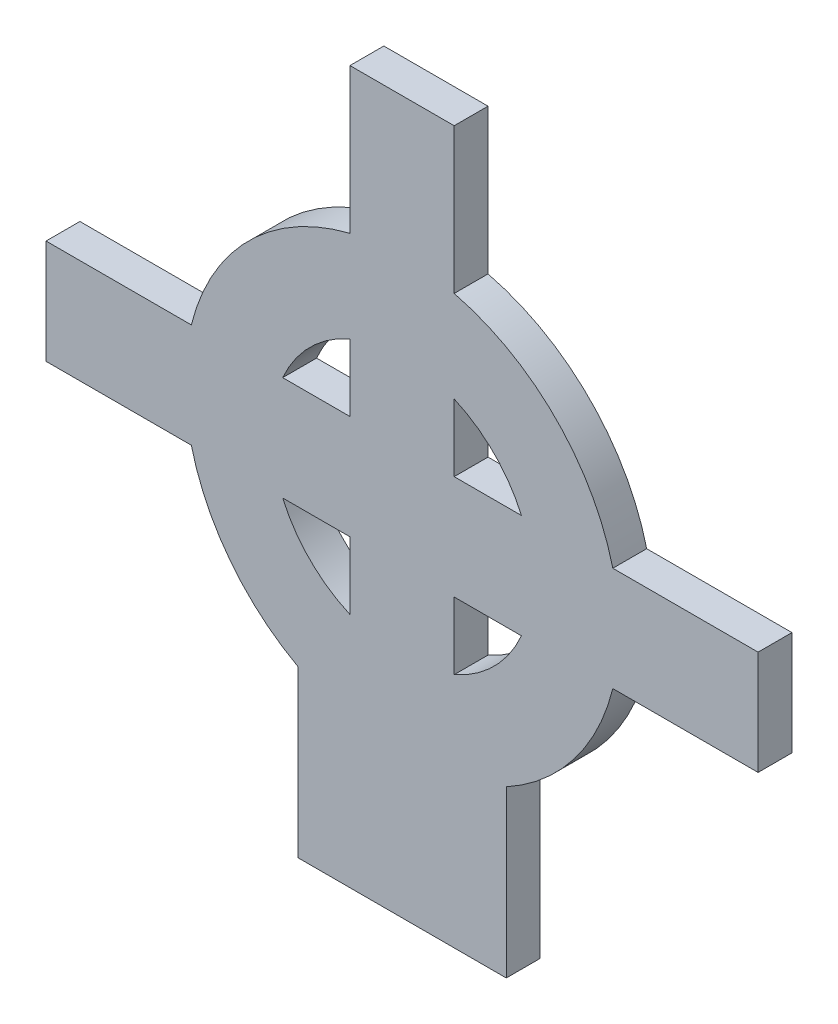
ISO-10303-21;
HEADER;
FILE_DESCRIPTION(('STEP AP214'),'2;1');
FILE_NAME('part.step','',(''),(''),'','','');
FILE_SCHEMA(('AUTOMOTIVE_DESIGN { 1 0 10303 214 1 1 1 1 }'));
ENDSEC;
DATA;
#1=APPLICATION_CONTEXT('core data for automotive mechanical design processes');
#2=APPLICATION_PROTOCOL_DEFINITION('international standard','automotive_design',2000,#1);
#3=PRODUCT_CONTEXT('',#1,'mechanical');
#4=PRODUCT('Part','Part','',(#3));
#5=PRODUCT_RELATED_PRODUCT_CATEGORY('part','',(#4));
#6=PRODUCT_DEFINITION_FORMATION('','',#4);
#7=PRODUCT_DEFINITION_CONTEXT('part definition',#1,'design');
#8=PRODUCT_DEFINITION('design','',#6,#7);
#9=PRODUCT_DEFINITION_SHAPE('','',#8);
#10=(LENGTH_UNIT() NAMED_UNIT(*) SI_UNIT(.MILLI.,.METRE.));
#11=(NAMED_UNIT(*) PLANE_ANGLE_UNIT() SI_UNIT($,.RADIAN.));
#12=(NAMED_UNIT(*) SI_UNIT($,.STERADIAN.) SOLID_ANGLE_UNIT());
#13=UNCERTAINTY_MEASURE_WITH_UNIT(LENGTH_MEASURE(1.E-05),#10,'distance_accuracy_value','');
#14=(GEOMETRIC_REPRESENTATION_CONTEXT(3) GLOBAL_UNCERTAINTY_ASSIGNED_CONTEXT((#13)) GLOBAL_UNIT_ASSIGNED_CONTEXT((#10,
#11,#12)) REPRESENTATION_CONTEXT('',''));
#15=CARTESIAN_POINT('',(0.,0.,0.));
#16=DIRECTION('',(0.,0.,1.));
#17=DIRECTION('',(1.,0.,0.));
#18=AXIS2_PLACEMENT_3D('',#15,#16,#17);
#19=CARTESIAN_POINT('',(-6.,20.5,1.95));
#20=DIRECTION('',(0.,0.,1.));
#21=DIRECTION('',(1.,0.,0.));
#22=AXIS2_PLACEMENT_3D('',#19,#20,#21);
#23=PLANE('',#22);
#24=DIRECTION('',(0.,1.,0.));
#25=VECTOR('',#24,1.);
#26=CARTESIAN_POINT('',(0.,0.,1.95));
#27=LINE('',#26,#25);
#28=CARTESIAN_POINT('',(0.,0.,1.95));
#29=VERTEX_POINT('',#28);
#30=CARTESIAN_POINT('',(0.,9.53414390026935,1.95));
#31=VERTEX_POINT('',#30);
#32=EDGE_CURVE('E317',#29,#31,#27,.T.);
#33=ORIENTED_EDGE('',*,*,#32,.T.);
#34=CARTESIAN_POINT('',(-6.,20.5,1.95));
#35=DIRECTION('',(0.,0.,1.));
#36=DIRECTION('',(1.,0.,0.));
#37=AXIS2_PLACEMENT_3D('',#34,#35,#36);
#38=CIRCLE('',#37,12.5);
#39=CARTESIAN_POINT('',(6.13466109951159,17.5,1.95));
#40=VERTEX_POINT('',#39);
#41=EDGE_CURVE('E320',#31,#40,#38,.T.);
#42=ORIENTED_EDGE('',*,*,#41,.T.);
#43=DIRECTION('',(1.,0.,0.));
#44=VECTOR('',#43,1.);
#45=CARTESIAN_POINT('',(14.5,17.5,1.95));
#46=LINE('',#45,#44);
#47=CARTESIAN_POINT('',(14.5,17.5,1.95));
#48=VERTEX_POINT('',#47);
#49=EDGE_CURVE('E323',#40,#48,#46,.T.);
#50=ORIENTED_EDGE('',*,*,#49,.T.);
#51=DIRECTION('',(0.,1.,0.));
#52=VECTOR('',#51,1.);
#53=CARTESIAN_POINT('',(14.5,17.5,1.95));
#54=LINE('',#53,#52);
#55=CARTESIAN_POINT('',(14.5,23.5,1.95));
#56=VERTEX_POINT('',#55);
#57=EDGE_CURVE('E325',#48,#56,#54,.T.);
#58=ORIENTED_EDGE('',*,*,#57,.T.);
#59=DIRECTION('',(-1.,0.,0.));
#60=VECTOR('',#59,1.);
#61=CARTESIAN_POINT('',(14.5,23.5,1.95));
#62=LINE('',#61,#60);
#63=CARTESIAN_POINT('',(6.13466109951159,23.5,1.95));
#64=VERTEX_POINT('',#63);
#65=EDGE_CURVE('E327',#56,#64,#62,.T.);
#66=ORIENTED_EDGE('',*,*,#65,.T.);
#67=CARTESIAN_POINT('',(-6.,20.5,1.95));
#68=DIRECTION('',(0.,0.,1.));
#69=DIRECTION('',(1.,0.,0.));
#70=AXIS2_PLACEMENT_3D('',#67,#68,#69);
#71=CIRCLE('',#70,12.5);
#72=CARTESIAN_POINT('',(-3.,32.6346610995116,1.95));
#73=VERTEX_POINT('',#72);
#74=EDGE_CURVE('E329',#64,#73,#71,.T.);
#75=ORIENTED_EDGE('',*,*,#74,.T.);
#76=DIRECTION('',(0.,1.,0.));
#77=VECTOR('',#76,1.);
#78=CARTESIAN_POINT('',(-3.,32.6346610995116,1.95));
#79=LINE('',#78,#77);
#80=CARTESIAN_POINT('',(-3.,41.,1.95));
#81=VERTEX_POINT('',#80);
#82=EDGE_CURVE('E331',#73,#81,#79,.T.);
#83=ORIENTED_EDGE('',*,*,#82,.T.);
#84=DIRECTION('',(-1.,0.,0.));
#85=VECTOR('',#84,1.);
#86=CARTESIAN_POINT('',(-9.,41.,1.95));
#87=LINE('',#86,#85);
#88=CARTESIAN_POINT('',(-9.,41.,1.95));
#89=VERTEX_POINT('',#88);
#90=EDGE_CURVE('E333',#81,#89,#87,.T.);
#91=ORIENTED_EDGE('',*,*,#90,.T.);
#92=DIRECTION('',(0.,-1.,0.));
#93=VECTOR('',#92,1.);
#94=CARTESIAN_POINT('',(-9.,32.6346610995116,1.95));
#95=LINE('',#94,#93);
#96=CARTESIAN_POINT('',(-9.,32.6346610995116,1.95));
#97=VERTEX_POINT('',#96);
#98=EDGE_CURVE('E335',#89,#97,#95,.T.);
#99=ORIENTED_EDGE('',*,*,#98,.T.);
#100=CARTESIAN_POINT('',(-6.,20.5,1.95));
#101=DIRECTION('',(0.,0.,1.));
#102=DIRECTION('',(1.,0.,0.));
#103=AXIS2_PLACEMENT_3D('',#100,#101,#102);
#104=CIRCLE('',#103,12.5);
#105=CARTESIAN_POINT('',(-18.1346610995116,23.5,1.95));
#106=VERTEX_POINT('',#105);
#107=EDGE_CURVE('E337',#97,#106,#104,.T.);
#108=ORIENTED_EDGE('',*,*,#107,.T.);
#109=DIRECTION('',(-1.,0.,0.));
#110=VECTOR('',#109,1.);
#111=CARTESIAN_POINT('',(-18.1346610995116,23.5,1.95));
#112=LINE('',#111,#110);
#113=CARTESIAN_POINT('',(-26.5,23.5,1.95));
#114=VERTEX_POINT('',#113);
#115=EDGE_CURVE('E339',#106,#114,#112,.T.);
#116=ORIENTED_EDGE('',*,*,#115,.T.);
#117=DIRECTION('',(0.,-1.,0.));
#118=VECTOR('',#117,1.);
#119=CARTESIAN_POINT('',(-26.5,17.5,1.95));
#120=LINE('',#119,#118);
#121=CARTESIAN_POINT('',(-26.5,17.5,1.95));
#122=VERTEX_POINT('',#121);
#123=EDGE_CURVE('E341',#114,#122,#120,.T.);
#124=ORIENTED_EDGE('',*,*,#123,.T.);
#125=DIRECTION('',(1.,0.,0.));
#126=VECTOR('',#125,1.);
#127=CARTESIAN_POINT('',(-18.1346610995116,17.5,1.95));
#128=LINE('',#127,#126);
#129=CARTESIAN_POINT('',(-18.1346610995116,17.5,1.95));
#130=VERTEX_POINT('',#129);
#131=EDGE_CURVE('E343',#122,#130,#128,.T.);
#132=ORIENTED_EDGE('',*,*,#131,.T.);
#133=CARTESIAN_POINT('',(-6.,20.5,1.95));
#134=DIRECTION('',(0.,0.,1.));
#135=DIRECTION('',(1.,0.,0.));
#136=AXIS2_PLACEMENT_3D('',#133,#134,#135);
#137=CIRCLE('',#136,12.5);
#138=CARTESIAN_POINT('',(-12.,9.53414390026935,1.95));
#139=VERTEX_POINT('',#138);
#140=EDGE_CURVE('E345',#130,#139,#137,.T.);
#141=ORIENTED_EDGE('',*,*,#140,.T.);
#142=DIRECTION('',(0.,-1.,0.));
#143=VECTOR('',#142,1.);
#144=CARTESIAN_POINT('',(-12.,0.,1.95));
#145=LINE('',#144,#143);
#146=CARTESIAN_POINT('',(-12.,0.,1.95));
#147=VERTEX_POINT('',#146);
#148=EDGE_CURVE('E347',#139,#147,#145,.T.);
#149=ORIENTED_EDGE('',*,*,#148,.T.);
#150=DIRECTION('',(1.,0.,0.));
#151=VECTOR('',#150,1.);
#152=CARTESIAN_POINT('',(0.,0.,1.95));
#153=LINE('',#152,#151);
#154=EDGE_CURVE('E349',#147,#29,#153,.T.);
#155=ORIENTED_EDGE('',*,*,#154,.T.);
#156=EDGE_LOOP('',(#33,#42,#50,#58,#66,#75,#83,#91,#99,#108,#116,#124,#132,#141,#149,#155));
#157=FACE_BOUND('',#156,.T.);
#158=DIRECTION('',(0.,1.,0.));
#159=VECTOR('',#158,1.);
#160=CARTESIAN_POINT('',(-9.,23.5,1.95));
#161=LINE('',#160,#159);
#162=CARTESIAN_POINT('',(-9.,23.5,1.95));
#163=VERTEX_POINT('',#162);
#164=CARTESIAN_POINT('',(-9.,27.3738635424338,1.95));
#165=VERTEX_POINT('',#164);
#166=EDGE_CURVE('E295',#163,#165,#161,.T.);
#167=ORIENTED_EDGE('',*,*,#166,.F.);
#168=DIRECTION('',(1.,0.,0.));
#169=VECTOR('',#168,1.);
#170=CARTESIAN_POINT('',(-9.,23.5,1.95));
#171=LINE('',#170,#169);
#172=CARTESIAN_POINT('',(-12.8738635424338,23.5,1.95));
#173=VERTEX_POINT('',#172);
#174=EDGE_CURVE('E293',#173,#163,#171,.T.);
#175=ORIENTED_EDGE('',*,*,#174,.F.);
#176=CARTESIAN_POINT('',(-6.,20.5,1.95));
#177=DIRECTION('',(0.,0.,1.));
#178=DIRECTION('',(1.,0.,0.));
#179=AXIS2_PLACEMENT_3D('',#176,#177,#178);
#180=CIRCLE('',#179,7.5);
#181=EDGE_CURVE('E299',#165,#173,#180,.T.);
#182=ORIENTED_EDGE('',*,*,#181,.F.);
#183=EDGE_LOOP('',(#167,#175,#182));
#184=FACE_BOUND('',#183,.T.);
#185=DIRECTION('',(0.,-1.,0.));
#186=VECTOR('',#185,1.);
#187=CARTESIAN_POINT('',(-3.,23.5,1.95));
#188=LINE('',#187,#186);
#189=CARTESIAN_POINT('',(-3.,27.3738635424338,1.95));
#190=VERTEX_POINT('',#189);
#191=CARTESIAN_POINT('',(-3.,23.5,1.95));
#192=VERTEX_POINT('',#191);
#193=EDGE_CURVE('E271',#190,#192,#188,.T.);
#194=ORIENTED_EDGE('',*,*,#193,.F.);
#195=CARTESIAN_POINT('',(-6.,20.5,1.95));
#196=DIRECTION('',(0.,0.,1.));
#197=DIRECTION('',(1.,0.,0.));
#198=AXIS2_PLACEMENT_3D('',#195,#196,#197);
#199=CIRCLE('',#198,7.5);
#200=CARTESIAN_POINT('',(0.87386354243376,23.5,1.95));
#201=VERTEX_POINT('',#200);
#202=EDGE_CURVE('E269',#201,#190,#199,.T.);
#203=ORIENTED_EDGE('',*,*,#202,.F.);
#204=DIRECTION('',(1.,0.,0.));
#205=VECTOR('',#204,1.);
#206=CARTESIAN_POINT('',(0.87386354243376,23.5,1.95));
#207=LINE('',#206,#205);
#208=EDGE_CURVE('E275',#192,#201,#207,.T.);
#209=ORIENTED_EDGE('',*,*,#208,.F.);
#210=EDGE_LOOP('',(#194,#203,#209));
#211=FACE_BOUND('',#210,.T.);
#212=CARTESIAN_POINT('',(-6.,20.5,1.95));
#213=DIRECTION('',(0.,0.,1.));
#214=DIRECTION('',(1.,0.,0.));
#215=AXIS2_PLACEMENT_3D('',#212,#213,#214);
#216=CIRCLE('',#215,7.5);
#217=CARTESIAN_POINT('',(-12.8738635424338,17.5,1.95));
#218=VERTEX_POINT('',#217);
#219=CARTESIAN_POINT('',(-9.,13.6261364575662,1.95));
#220=VERTEX_POINT('',#219);
#221=EDGE_CURVE('E247',#218,#220,#216,.T.);
#222=ORIENTED_EDGE('',*,*,#221,.F.);
#223=DIRECTION('',(-1.,0.,0.));
#224=VECTOR('',#223,1.);
#225=CARTESIAN_POINT('',(-9.,17.5,1.95));
#226=LINE('',#225,#224);
#227=CARTESIAN_POINT('',(-9.,17.5,1.95));
#228=VERTEX_POINT('',#227);
#229=EDGE_CURVE('E245',#228,#218,#226,.T.);
#230=ORIENTED_EDGE('',*,*,#229,.F.);
#231=DIRECTION('',(0.,1.,0.));
#232=VECTOR('',#231,1.);
#233=CARTESIAN_POINT('',(-9.,17.5,1.95));
#234=LINE('',#233,#232);
#235=EDGE_CURVE('E251',#220,#228,#234,.T.);
#236=ORIENTED_EDGE('',*,*,#235,.F.);
#237=EDGE_LOOP('',(#222,#230,#236));
#238=FACE_BOUND('',#237,.T.);
#239=DIRECTION('',(0.,-1.,0.));
#240=VECTOR('',#239,1.);
#241=CARTESIAN_POINT('',(-3.,17.5,1.95));
#242=LINE('',#241,#240);
#243=CARTESIAN_POINT('',(-3.,17.5,1.95));
#244=VERTEX_POINT('',#243);
#245=CARTESIAN_POINT('',(-3.,13.6261364575662,1.95));
#246=VERTEX_POINT('',#245);
#247=EDGE_CURVE('E226',#244,#246,#242,.T.);
#248=ORIENTED_EDGE('',*,*,#247,.F.);
#249=DIRECTION('',(-1.,0.,0.));
#250=VECTOR('',#249,1.);
#251=CARTESIAN_POINT('',(0.87386354243376,17.5,1.95));
#252=LINE('',#251,#250);
#253=CARTESIAN_POINT('',(0.873863542433758,17.5,1.95));
#254=VERTEX_POINT('',#253);
#255=EDGE_CURVE('E218',#254,#244,#252,.T.);
#256=ORIENTED_EDGE('',*,*,#255,.F.);
#257=CARTESIAN_POINT('',(-6.,20.5,1.95));
#258=DIRECTION('',(0.,0.,1.));
#259=DIRECTION('',(1.,0.,0.));
#260=AXIS2_PLACEMENT_3D('',#257,#258,#259);
#261=CIRCLE('',#260,7.5);
#262=EDGE_CURVE('E235',#246,#254,#261,.T.);
#263=ORIENTED_EDGE('',*,*,#262,.F.);
#264=EDGE_LOOP('',(#248,#256,#263));
#265=FACE_BOUND('',#264,.T.);
#266=ADVANCED_FACE('F33',(#157,#184,#211,#238,#265),#23,.T.);
#267=CARTESIAN_POINT('',(-6.,20.5,0.));
#268=DIRECTION('',(0.,0.,1.));
#269=DIRECTION('',(1.,0.,0.));
#270=AXIS2_PLACEMENT_3D('',#267,#268,#269);
#271=PLANE('',#270);
#272=DIRECTION('',(-1.,0.,0.));
#273=VECTOR('',#272,1.);
#274=CARTESIAN_POINT('',(-9.,17.5,0.));
#275=LINE('',#274,#273);
#276=CARTESIAN_POINT('',(-9.,17.5,0.));
#277=VERTEX_POINT('',#276);
#278=CARTESIAN_POINT('',(-12.8738635424338,17.5,0.));
#279=VERTEX_POINT('',#278);
#280=EDGE_CURVE('E233',#277,#279,#275,.T.);
#281=ORIENTED_EDGE('',*,*,#280,.T.);
#282=CARTESIAN_POINT('',(-6.,20.5,0.));
#283=DIRECTION('',(0.,0.,1.));
#284=DIRECTION('',(1.,0.,0.));
#285=AXIS2_PLACEMENT_3D('',#282,#283,#284);
#286=CIRCLE('',#285,7.5);
#287=CARTESIAN_POINT('',(-9.,13.6261364575662,0.));
#288=VERTEX_POINT('',#287);
#289=EDGE_CURVE('E256',#279,#288,#286,.T.);
#290=ORIENTED_EDGE('',*,*,#289,.T.);
#291=DIRECTION('',(0.,1.,0.));
#292=VECTOR('',#291,1.);
#293=CARTESIAN_POINT('',(-9.,17.5,0.));
#294=LINE('',#293,#292);
#295=EDGE_CURVE('E248',#288,#277,#294,.T.);
#296=ORIENTED_EDGE('',*,*,#295,.T.);
#297=EDGE_LOOP('',(#281,#290,#296));
#298=FACE_BOUND('',#297,.T.);
#299=DIRECTION('',(1.,0.,0.));
#300=VECTOR('',#299,1.);
#301=CARTESIAN_POINT('',(-9.,23.5,0.));
#302=LINE('',#301,#300);
#303=CARTESIAN_POINT('',(-12.8738635424338,23.5,0.));
#304=VERTEX_POINT('',#303);
#305=CARTESIAN_POINT('',(-9.,23.5,0.));
#306=VERTEX_POINT('',#305);
#307=EDGE_CURVE('E292',#304,#306,#302,.T.);
#308=ORIENTED_EDGE('',*,*,#307,.T.);
#309=DIRECTION('',(0.,1.,0.));
#310=VECTOR('',#309,1.);
#311=CARTESIAN_POINT('',(-9.,23.5,0.));
#312=LINE('',#311,#310);
#313=CARTESIAN_POINT('',(-9.,27.3738635424338,0.));
#314=VERTEX_POINT('',#313);
#315=EDGE_CURVE('E304',#306,#314,#312,.T.);
#316=ORIENTED_EDGE('',*,*,#315,.T.);
#317=CARTESIAN_POINT('',(-6.,20.5,0.));
#318=DIRECTION('',(0.,0.,1.));
#319=DIRECTION('',(1.,0.,0.));
#320=AXIS2_PLACEMENT_3D('',#317,#318,#319);
#321=CIRCLE('',#320,7.5);
#322=EDGE_CURVE('E296',#314,#304,#321,.T.);
#323=ORIENTED_EDGE('',*,*,#322,.T.);
#324=EDGE_LOOP('',(#308,#316,#323));
#325=FACE_BOUND('',#324,.T.);
#326=DIRECTION('',(0.,1.,0.));
#327=VECTOR('',#326,1.);
#328=CARTESIAN_POINT('',(0.,0.,0.));
#329=LINE('',#328,#327);
#330=CARTESIAN_POINT('',(0.,0.,0.));
#331=VERTEX_POINT('',#330);
#332=CARTESIAN_POINT('',(0.,9.53414390026935,0.));
#333=VERTEX_POINT('',#332);
#334=EDGE_CURVE('E316',#331,#333,#329,.T.);
#335=ORIENTED_EDGE('',*,*,#334,.F.);
#336=DIRECTION('',(1.,0.,0.));
#337=VECTOR('',#336,1.);
#338=CARTESIAN_POINT('',(0.,0.,0.));
#339=LINE('',#338,#337);
#340=CARTESIAN_POINT('',(-12.,0.,0.));
#341=VERTEX_POINT('',#340);
#342=EDGE_CURVE('E321',#341,#331,#339,.T.);
#343=ORIENTED_EDGE('',*,*,#342,.F.);
#344=DIRECTION('',(0.,-1.,0.));
#345=VECTOR('',#344,1.);
#346=CARTESIAN_POINT('',(-12.,0.,0.));
#347=LINE('',#346,#345);
#348=CARTESIAN_POINT('',(-12.,9.53414390026935,0.));
#349=VERTEX_POINT('',#348);
#350=EDGE_CURVE('E380',#349,#341,#347,.T.);
#351=ORIENTED_EDGE('',*,*,#350,.F.);
#352=CARTESIAN_POINT('',(-6.,20.5,0.));
#353=DIRECTION('',(0.,0.,1.));
#354=DIRECTION('',(1.,0.,0.));
#355=AXIS2_PLACEMENT_3D('',#352,#353,#354);
#356=CIRCLE('',#355,12.5);
#357=CARTESIAN_POINT('',(-18.1346610995116,17.5,0.));
#358=VERTEX_POINT('',#357);
#359=EDGE_CURVE('E378',#358,#349,#356,.T.);
#360=ORIENTED_EDGE('',*,*,#359,.F.);
#361=DIRECTION('',(1.,0.,0.));
#362=VECTOR('',#361,1.);
#363=CARTESIAN_POINT('',(-18.1346610995116,17.5,0.));
#364=LINE('',#363,#362);
#365=CARTESIAN_POINT('',(-26.5,17.5,0.));
#366=VERTEX_POINT('',#365);
#367=EDGE_CURVE('E376',#366,#358,#364,.T.);
#368=ORIENTED_EDGE('',*,*,#367,.F.);
#369=DIRECTION('',(0.,-1.,0.));
#370=VECTOR('',#369,1.);
#371=CARTESIAN_POINT('',(-26.5,17.5,0.));
#372=LINE('',#371,#370);
#373=CARTESIAN_POINT('',(-26.5,23.5,0.));
#374=VERTEX_POINT('',#373);
#375=EDGE_CURVE('E374',#374,#366,#372,.T.);
#376=ORIENTED_EDGE('',*,*,#375,.F.);
#377=DIRECTION('',(-1.,0.,0.));
#378=VECTOR('',#377,1.);
#379=CARTESIAN_POINT('',(-18.1346610995116,23.5,0.));
#380=LINE('',#379,#378);
#381=CARTESIAN_POINT('',(-18.1346610995116,23.5,0.));
#382=VERTEX_POINT('',#381);
#383=EDGE_CURVE('E372',#382,#374,#380,.T.);
#384=ORIENTED_EDGE('',*,*,#383,.F.);
#385=CARTESIAN_POINT('',(-6.,20.5,0.));
#386=DIRECTION('',(0.,0.,1.));
#387=DIRECTION('',(1.,0.,0.));
#388=AXIS2_PLACEMENT_3D('',#385,#386,#387);
#389=CIRCLE('',#388,12.5);
#390=CARTESIAN_POINT('',(-9.,32.6346610995116,0.));
#391=VERTEX_POINT('',#390);
#392=EDGE_CURVE('E370',#391,#382,#389,.T.);
#393=ORIENTED_EDGE('',*,*,#392,.F.);
#394=DIRECTION('',(0.,-1.,0.));
#395=VECTOR('',#394,1.);
#396=CARTESIAN_POINT('',(-9.,32.6346610995116,0.));
#397=LINE('',#396,#395);
#398=CARTESIAN_POINT('',(-9.,41.,0.));
#399=VERTEX_POINT('',#398);
#400=EDGE_CURVE('E368',#399,#391,#397,.T.);
#401=ORIENTED_EDGE('',*,*,#400,.F.);
#402=DIRECTION('',(-1.,0.,0.));
#403=VECTOR('',#402,1.);
#404=CARTESIAN_POINT('',(-9.,41.,0.));
#405=LINE('',#404,#403);
#406=CARTESIAN_POINT('',(-3.,41.,0.));
#407=VERTEX_POINT('',#406);
#408=EDGE_CURVE('E366',#407,#399,#405,.T.);
#409=ORIENTED_EDGE('',*,*,#408,.F.);
#410=DIRECTION('',(0.,1.,0.));
#411=VECTOR('',#410,1.);
#412=CARTESIAN_POINT('',(-3.,32.6346610995116,0.));
#413=LINE('',#412,#411);
#414=CARTESIAN_POINT('',(-3.,32.6346610995116,0.));
#415=VERTEX_POINT('',#414);
#416=EDGE_CURVE('E364',#415,#407,#413,.T.);
#417=ORIENTED_EDGE('',*,*,#416,.F.);
#418=CARTESIAN_POINT('',(-6.,20.5,0.));
#419=DIRECTION('',(0.,0.,1.));
#420=DIRECTION('',(1.,0.,0.));
#421=AXIS2_PLACEMENT_3D('',#418,#419,#420);
#422=CIRCLE('',#421,12.5);
#423=CARTESIAN_POINT('',(6.13466109951159,23.5,0.));
#424=VERTEX_POINT('',#423);
#425=EDGE_CURVE('E362',#424,#415,#422,.T.);
#426=ORIENTED_EDGE('',*,*,#425,.F.);
#427=DIRECTION('',(-1.,0.,0.));
#428=VECTOR('',#427,1.);
#429=CARTESIAN_POINT('',(14.5,23.5,0.));
#430=LINE('',#429,#428);
#431=CARTESIAN_POINT('',(14.5,23.5,0.));
#432=VERTEX_POINT('',#431);
#433=EDGE_CURVE('E360',#432,#424,#430,.T.);
#434=ORIENTED_EDGE('',*,*,#433,.F.);
#435=DIRECTION('',(0.,1.,0.));
#436=VECTOR('',#435,1.);
#437=CARTESIAN_POINT('',(14.5,17.5,0.));
#438=LINE('',#437,#436);
#439=CARTESIAN_POINT('',(14.5,17.5,0.));
#440=VERTEX_POINT('',#439);
#441=EDGE_CURVE('E358',#440,#432,#438,.T.);
#442=ORIENTED_EDGE('',*,*,#441,.F.);
#443=DIRECTION('',(1.,0.,0.));
#444=VECTOR('',#443,1.);
#445=CARTESIAN_POINT('',(14.5,17.5,0.));
#446=LINE('',#445,#444);
#447=CARTESIAN_POINT('',(6.13466109951159,17.5,0.));
#448=VERTEX_POINT('',#447);
#449=EDGE_CURVE('E356',#448,#440,#446,.T.);
#450=ORIENTED_EDGE('',*,*,#449,.F.);
#451=CARTESIAN_POINT('',(-6.,20.5,0.));
#452=DIRECTION('',(0.,0.,1.));
#453=DIRECTION('',(1.,0.,0.));
#454=AXIS2_PLACEMENT_3D('',#451,#452,#453);
#455=CIRCLE('',#454,12.5);
#456=EDGE_CURVE('E354',#333,#448,#455,.T.);
#457=ORIENTED_EDGE('',*,*,#456,.F.);
#458=EDGE_LOOP('',(#335,#343,#351,#360,#368,#376,#384,#393,#401,#409,#417,#426,#434,#442,#450,#457));
#459=FACE_BOUND('',#458,.T.);
#460=CARTESIAN_POINT('',(-6.,20.5,0.));
#461=DIRECTION('',(0.,0.,1.));
#462=DIRECTION('',(1.,0.,0.));
#463=AXIS2_PLACEMENT_3D('',#460,#461,#462);
#464=CIRCLE('',#463,7.5);
#465=CARTESIAN_POINT('',(0.87386354243376,23.5,0.));
#466=VERTEX_POINT('',#465);
#467=CARTESIAN_POINT('',(-3.,27.3738635424338,0.));
#468=VERTEX_POINT('',#467);
#469=EDGE_CURVE('E268',#466,#468,#464,.T.);
#470=ORIENTED_EDGE('',*,*,#469,.T.);
#471=DIRECTION('',(0.,-1.,0.));
#472=VECTOR('',#471,1.);
#473=CARTESIAN_POINT('',(-3.,23.5,0.));
#474=LINE('',#473,#472);
#475=CARTESIAN_POINT('',(-3.,23.5,0.));
#476=VERTEX_POINT('',#475);
#477=EDGE_CURVE('E280',#468,#476,#474,.T.);
#478=ORIENTED_EDGE('',*,*,#477,.T.);
#479=DIRECTION('',(1.,0.,0.));
#480=VECTOR('',#479,1.);
#481=CARTESIAN_POINT('',(0.87386354243376,23.5,0.));
#482=LINE('',#481,#480);
#483=EDGE_CURVE('E272',#476,#466,#482,.T.);
#484=ORIENTED_EDGE('',*,*,#483,.T.);
#485=EDGE_LOOP('',(#470,#478,#484));
#486=FACE_BOUND('',#485,.T.);
#487=DIRECTION('',(-1.,0.,0.));
#488=VECTOR('',#487,1.);
#489=CARTESIAN_POINT('',(0.87386354243376,17.5,0.));
#490=LINE('',#489,#488);
#491=CARTESIAN_POINT('',(0.873863542433759,17.5,0.));
#492=VERTEX_POINT('',#491);
#493=CARTESIAN_POINT('',(-3.,17.5,0.));
#494=VERTEX_POINT('',#493);
#495=EDGE_CURVE('E56',#492,#494,#490,.T.);
#496=ORIENTED_EDGE('',*,*,#495,.T.);
#497=DIRECTION('',(0.,-1.,0.));
#498=VECTOR('',#497,1.);
#499=CARTESIAN_POINT('',(-3.,17.5,0.));
#500=LINE('',#499,#498);
#501=CARTESIAN_POINT('',(-3.,13.6261364575662,0.));
#502=VERTEX_POINT('',#501);
#503=EDGE_CURVE('E232',#494,#502,#500,.T.);
#504=ORIENTED_EDGE('',*,*,#503,.T.);
#505=CARTESIAN_POINT('',(-6.,20.5,0.));
#506=DIRECTION('',(0.,0.,1.));
#507=DIRECTION('',(1.,0.,0.));
#508=AXIS2_PLACEMENT_3D('',#505,#506,#507);
#509=CIRCLE('',#508,7.5);
#510=EDGE_CURVE('E227',#502,#492,#509,.T.);
#511=ORIENTED_EDGE('',*,*,#510,.T.);
#512=EDGE_LOOP('',(#496,#504,#511));
#513=FACE_BOUND('',#512,.T.);
#514=ADVANCED_FACE('F434',(#298,#325,#459,#486,#513),#271,.F.);
#515=CARTESIAN_POINT('',(0.,0.,1.95));
#516=DIRECTION('',(-1.,0.,0.));
#517=DIRECTION('',(0.,-1.,0.));
#518=AXIS2_PLACEMENT_3D('',#515,#516,#517);
#519=PLANE('',#518);
#520=ORIENTED_EDGE('',*,*,#334,.T.);
#521=DIRECTION('',(0.,0.,-1.));
#522=VECTOR('',#521,1.);
#523=CARTESIAN_POINT('',(0.,9.53414390026935,1.95));
#524=LINE('',#523,#522);
#525=EDGE_CURVE('E11',#31,#333,#524,.T.);
#526=ORIENTED_EDGE('',*,*,#525,.F.);
#527=ORIENTED_EDGE('',*,*,#32,.F.);
#528=DIRECTION('',(0.,0.,-1.));
#529=VECTOR('',#528,1.);
#530=CARTESIAN_POINT('',(0.,0.,1.95));
#531=LINE('',#530,#529);
#532=EDGE_CURVE('E351',#29,#331,#531,.T.);
#533=ORIENTED_EDGE('',*,*,#532,.T.);
#534=EDGE_LOOP('',(#520,#526,#527,#533));
#535=FACE_BOUND('',#534,.T.);
#536=ADVANCED_FACE('F35',(#535),#519,.F.);
#537=CARTESIAN_POINT('',(-6.,20.5,1.95));
#538=DIRECTION('',(0.,0.,-1.));
#539=DIRECTION('',(-1.,0.,0.));
#540=AXIS2_PLACEMENT_3D('',#537,#538,#539);
#541=CYLINDRICAL_SURFACE('',#540,12.5);
#542=ORIENTED_EDGE('',*,*,#456,.T.);
#543=DIRECTION('',(0.,0.,-1.));
#544=VECTOR('',#543,1.);
#545=CARTESIAN_POINT('',(6.13466109951159,17.5,1.95));
#546=LINE('',#545,#544);
#547=EDGE_CURVE('E41',#40,#448,#546,.T.);
#548=ORIENTED_EDGE('',*,*,#547,.F.);
#549=ORIENTED_EDGE('',*,*,#41,.F.);
#550=ORIENTED_EDGE('',*,*,#525,.T.);
#551=EDGE_LOOP('',(#542,#548,#549,#550));
#552=FACE_BOUND('',#551,.T.);
#553=ADVANCED_FACE('F452',(#552),#541,.T.);
#554=CARTESIAN_POINT('',(14.5,17.5,1.95));
#555=DIRECTION('',(0.,1.,0.));
#556=DIRECTION('',(0.,0.,1.));
#557=AXIS2_PLACEMENT_3D('',#554,#555,#556);
#558=PLANE('',#557);
#559=ORIENTED_EDGE('',*,*,#449,.T.);
#560=DIRECTION('',(0.,0.,-1.));
#561=VECTOR('',#560,1.);
#562=CARTESIAN_POINT('',(14.5,17.5,1.95));
#563=LINE('',#562,#561);
#564=EDGE_CURVE('E421',#48,#440,#563,.T.);
#565=ORIENTED_EDGE('',*,*,#564,.F.);
#566=ORIENTED_EDGE('',*,*,#49,.F.);
#567=ORIENTED_EDGE('',*,*,#547,.T.);
#568=EDGE_LOOP('',(#559,#565,#566,#567));
#569=FACE_BOUND('',#568,.T.);
#570=ADVANCED_FACE('F428',(#569),#558,.F.);
#571=CARTESIAN_POINT('',(14.5,17.5,1.95));
#572=DIRECTION('',(-1.,0.,0.));
#573=DIRECTION('',(0.,0.,1.));
#574=AXIS2_PLACEMENT_3D('',#571,#572,#573);
#575=PLANE('',#574);
#576=ORIENTED_EDGE('',*,*,#441,.T.);
#577=DIRECTION('',(0.,0.,-1.));
#578=VECTOR('',#577,1.);
#579=CARTESIAN_POINT('',(14.5,23.5,1.95));
#580=LINE('',#579,#578);
#581=EDGE_CURVE('E418',#56,#432,#580,.T.);
#582=ORIENTED_EDGE('',*,*,#581,.F.);
#583=ORIENTED_EDGE('',*,*,#57,.F.);
#584=ORIENTED_EDGE('',*,*,#564,.T.);
#585=EDGE_LOOP('',(#576,#582,#583,#584));
#586=FACE_BOUND('',#585,.T.);
#587=ADVANCED_FACE('F440',(#586),#575,.F.);
#588=CARTESIAN_POINT('',(14.5,23.5,1.95));
#589=DIRECTION('',(0.,-1.,0.));
#590=DIRECTION('',(0.,0.,-1.));
#591=AXIS2_PLACEMENT_3D('',#588,#589,#590);
#592=PLANE('',#591);
#593=ORIENTED_EDGE('',*,*,#433,.T.);
#594=DIRECTION('',(0.,0.,-1.));
#595=VECTOR('',#594,1.);
#596=CARTESIAN_POINT('',(6.13466109951159,23.5,1.95));
#597=LINE('',#596,#595);
#598=EDGE_CURVE('E415',#64,#424,#597,.T.);
#599=ORIENTED_EDGE('',*,*,#598,.F.);
#600=ORIENTED_EDGE('',*,*,#65,.F.);
#601=ORIENTED_EDGE('',*,*,#581,.T.);
#602=EDGE_LOOP('',(#593,#599,#600,#601));
#603=FACE_BOUND('',#602,.T.);
#604=ADVANCED_FACE('F444',(#603),#592,.F.);
#605=CARTESIAN_POINT('',(-6.,20.5,1.95));
#606=DIRECTION('',(0.,0.,-1.));
#607=DIRECTION('',(-1.,0.,0.));
#608=AXIS2_PLACEMENT_3D('',#605,#606,#607);
#609=CYLINDRICAL_SURFACE('',#608,12.5);
#610=ORIENTED_EDGE('',*,*,#425,.T.);
#611=DIRECTION('',(0.,0.,-1.));
#612=VECTOR('',#611,1.);
#613=CARTESIAN_POINT('',(-3.,32.6346610995116,1.95));
#614=LINE('',#613,#612);
#615=EDGE_CURVE('E412',#73,#415,#614,.T.);
#616=ORIENTED_EDGE('',*,*,#615,.F.);
#617=ORIENTED_EDGE('',*,*,#74,.F.);
#618=ORIENTED_EDGE('',*,*,#598,.T.);
#619=EDGE_LOOP('',(#610,#616,#617,#618));
#620=FACE_BOUND('',#619,.T.);
#621=ADVANCED_FACE('F505',(#620),#609,.T.);
#622=CARTESIAN_POINT('',(-3.,32.6346610995116,1.95));
#623=DIRECTION('',(-1.,0.,0.));
#624=DIRECTION('',(0.,-1.,0.));
#625=AXIS2_PLACEMENT_3D('',#622,#623,#624);
#626=PLANE('',#625);
#627=ORIENTED_EDGE('',*,*,#416,.T.);
#628=DIRECTION('',(0.,0.,-1.));
#629=VECTOR('',#628,1.);
#630=CARTESIAN_POINT('',(-3.,41.,1.95));
#631=LINE('',#630,#629);
#632=EDGE_CURVE('E409',#81,#407,#631,.T.);
#633=ORIENTED_EDGE('',*,*,#632,.F.);
#634=ORIENTED_EDGE('',*,*,#82,.F.);
#635=ORIENTED_EDGE('',*,*,#615,.T.);
#636=EDGE_LOOP('',(#627,#633,#634,#635));
#637=FACE_BOUND('',#636,.T.);
#638=ADVANCED_FACE('F502',(#637),#626,.F.);
#639=CARTESIAN_POINT('',(-9.,41.,1.95));
#640=DIRECTION('',(0.,-1.,0.));
#641=DIRECTION('',(0.,0.,-1.));
#642=AXIS2_PLACEMENT_3D('',#639,#640,#641);
#643=PLANE('',#642);
#644=ORIENTED_EDGE('',*,*,#408,.T.);
#645=DIRECTION('',(0.,0.,-1.));
#646=VECTOR('',#645,1.);
#647=CARTESIAN_POINT('',(-9.,41.,1.95));
#648=LINE('',#647,#646);
#649=EDGE_CURVE('E406',#89,#399,#648,.T.);
#650=ORIENTED_EDGE('',*,*,#649,.F.);
#651=ORIENTED_EDGE('',*,*,#90,.F.);
#652=ORIENTED_EDGE('',*,*,#632,.T.);
#653=EDGE_LOOP('',(#644,#650,#651,#652));
#654=FACE_BOUND('',#653,.T.);
#655=ADVANCED_FACE('F498',(#654),#643,.F.);
#656=CARTESIAN_POINT('',(-9.,32.6346610995116,1.95));
#657=DIRECTION('',(1.,0.,0.));
#658=DIRECTION('',(0.,0.,-1.));
#659=AXIS2_PLACEMENT_3D('',#656,#657,#658);
#660=PLANE('',#659);
#661=ORIENTED_EDGE('',*,*,#400,.T.);
#662=DIRECTION('',(0.,0.,-1.));
#663=VECTOR('',#662,1.);
#664=CARTESIAN_POINT('',(-9.,32.6346610995116,1.95));
#665=LINE('',#664,#663);
#666=EDGE_CURVE('E403',#97,#391,#665,.T.);
#667=ORIENTED_EDGE('',*,*,#666,.F.);
#668=ORIENTED_EDGE('',*,*,#98,.F.);
#669=ORIENTED_EDGE('',*,*,#649,.T.);
#670=EDGE_LOOP('',(#661,#667,#668,#669));
#671=FACE_BOUND('',#670,.T.);
#672=ADVANCED_FACE('F494',(#671),#660,.F.);
#673=CARTESIAN_POINT('',(-6.,20.5,1.95));
#674=DIRECTION('',(0.,0.,-1.));
#675=DIRECTION('',(-1.,0.,0.));
#676=AXIS2_PLACEMENT_3D('',#673,#674,#675);
#677=CYLINDRICAL_SURFACE('',#676,12.5);
#678=ORIENTED_EDGE('',*,*,#392,.T.);
#679=DIRECTION('',(0.,0.,-1.));
#680=VECTOR('',#679,1.);
#681=CARTESIAN_POINT('',(-18.1346610995116,23.5,1.95));
#682=LINE('',#681,#680);
#683=EDGE_CURVE('E400',#106,#382,#682,.T.);
#684=ORIENTED_EDGE('',*,*,#683,.F.);
#685=ORIENTED_EDGE('',*,*,#107,.F.);
#686=ORIENTED_EDGE('',*,*,#666,.T.);
#687=EDGE_LOOP('',(#678,#684,#685,#686));
#688=FACE_BOUND('',#687,.T.);
#689=ADVANCED_FACE('F489',(#688),#677,.T.);
#690=CARTESIAN_POINT('',(-18.1346610995116,23.5,1.95));
#691=DIRECTION('',(0.,-1.,0.));
#692=DIRECTION('',(0.,0.,-1.));
#693=AXIS2_PLACEMENT_3D('',#690,#691,#692);
#694=PLANE('',#693);
#695=ORIENTED_EDGE('',*,*,#383,.T.);
#696=DIRECTION('',(0.,0.,-1.));
#697=VECTOR('',#696,1.);
#698=CARTESIAN_POINT('',(-26.5,23.5,1.95));
#699=LINE('',#698,#697);
#700=EDGE_CURVE('E397',#114,#374,#699,.T.);
#701=ORIENTED_EDGE('',*,*,#700,.F.);
#702=ORIENTED_EDGE('',*,*,#115,.F.);
#703=ORIENTED_EDGE('',*,*,#683,.T.);
#704=EDGE_LOOP('',(#695,#701,#702,#703));
#705=FACE_BOUND('',#704,.T.);
#706=ADVANCED_FACE('F483',(#705),#694,.F.);
#707=CARTESIAN_POINT('',(-26.5,17.5,1.95));
#708=DIRECTION('',(1.,0.,0.));
#709=DIRECTION('',(0.,0.,-1.));
#710=AXIS2_PLACEMENT_3D('',#707,#708,#709);
#711=PLANE('',#710);
#712=ORIENTED_EDGE('',*,*,#375,.T.);
#713=DIRECTION('',(0.,0.,-1.));
#714=VECTOR('',#713,1.);
#715=CARTESIAN_POINT('',(-26.5,17.5,1.95));
#716=LINE('',#715,#714);
#717=EDGE_CURVE('E394',#122,#366,#716,.T.);
#718=ORIENTED_EDGE('',*,*,#717,.F.);
#719=ORIENTED_EDGE('',*,*,#123,.F.);
#720=ORIENTED_EDGE('',*,*,#700,.T.);
#721=EDGE_LOOP('',(#712,#718,#719,#720));
#722=FACE_BOUND('',#721,.T.);
#723=ADVANCED_FACE('F479',(#722),#711,.F.);
#724=CARTESIAN_POINT('',(-18.1346610995116,17.5,1.95));
#725=DIRECTION('',(0.,1.,0.));
#726=DIRECTION('',(0.,0.,1.));
#727=AXIS2_PLACEMENT_3D('',#724,#725,#726);
#728=PLANE('',#727);
#729=ORIENTED_EDGE('',*,*,#367,.T.);
#730=DIRECTION('',(0.,0.,-1.));
#731=VECTOR('',#730,1.);
#732=CARTESIAN_POINT('',(-18.1346610995116,17.5,1.95));
#733=LINE('',#732,#731);
#734=EDGE_CURVE('E391',#130,#358,#733,.T.);
#735=ORIENTED_EDGE('',*,*,#734,.F.);
#736=ORIENTED_EDGE('',*,*,#131,.F.);
#737=ORIENTED_EDGE('',*,*,#717,.T.);
#738=EDGE_LOOP('',(#729,#735,#736,#737));
#739=FACE_BOUND('',#738,.T.);
#740=ADVANCED_FACE('F474',(#739),#728,.F.);
#741=CARTESIAN_POINT('',(-6.,20.5,1.95));
#742=DIRECTION('',(0.,0.,-1.));
#743=DIRECTION('',(-1.,0.,0.));
#744=AXIS2_PLACEMENT_3D('',#741,#742,#743);
#745=CYLINDRICAL_SURFACE('',#744,12.5);
#746=ORIENTED_EDGE('',*,*,#359,.T.);
#747=DIRECTION('',(0.,0.,-1.));
#748=VECTOR('',#747,1.);
#749=CARTESIAN_POINT('',(-12.,9.53414390026935,1.95));
#750=LINE('',#749,#748);
#751=EDGE_CURVE('E388',#139,#349,#750,.T.);
#752=ORIENTED_EDGE('',*,*,#751,.F.);
#753=ORIENTED_EDGE('',*,*,#140,.F.);
#754=ORIENTED_EDGE('',*,*,#734,.T.);
#755=EDGE_LOOP('',(#746,#752,#753,#754));
#756=FACE_BOUND('',#755,.T.);
#757=ADVANCED_FACE('F468',(#756),#745,.T.);
#758=CARTESIAN_POINT('',(-12.,0.,1.95));
#759=DIRECTION('',(1.,0.,0.));
#760=DIRECTION('',(0.,1.,0.));
#761=AXIS2_PLACEMENT_3D('',#758,#759,#760);
#762=PLANE('',#761);
#763=ORIENTED_EDGE('',*,*,#350,.T.);
#764=DIRECTION('',(0.,0.,-1.));
#765=VECTOR('',#764,1.);
#766=CARTESIAN_POINT('',(-12.,0.,1.95));
#767=LINE('',#766,#765);
#768=EDGE_CURVE('E385',#147,#341,#767,.T.);
#769=ORIENTED_EDGE('',*,*,#768,.F.);
#770=ORIENTED_EDGE('',*,*,#148,.F.);
#771=ORIENTED_EDGE('',*,*,#751,.T.);
#772=EDGE_LOOP('',(#763,#769,#770,#771));
#773=FACE_BOUND('',#772,.T.);
#774=ADVANCED_FACE('F464',(#773),#762,.F.);
#775=CARTESIAN_POINT('',(0.,0.,1.95));
#776=DIRECTION('',(0.,1.,0.));
#777=DIRECTION('',(-1.,0.,0.));
#778=AXIS2_PLACEMENT_3D('',#775,#776,#777);
#779=PLANE('',#778);
#780=ORIENTED_EDGE('',*,*,#342,.T.);
#781=ORIENTED_EDGE('',*,*,#532,.F.);
#782=ORIENTED_EDGE('',*,*,#154,.F.);
#783=ORIENTED_EDGE('',*,*,#768,.T.);
#784=EDGE_LOOP('',(#780,#781,#782,#783));
#785=FACE_BOUND('',#784,.T.);
#786=ADVANCED_FACE('F459',(#785),#779,.F.);
#787=CARTESIAN_POINT('',(-9.,23.5,1.95));
#788=DIRECTION('',(0.,1.,0.));
#789=DIRECTION('',(0.,0.,1.));
#790=AXIS2_PLACEMENT_3D('',#787,#788,#789);
#791=PLANE('',#790);
#792=ORIENTED_EDGE('',*,*,#307,.F.);
#793=DIRECTION('',(0.,0.,-1.));
#794=VECTOR('',#793,1.);
#795=CARTESIAN_POINT('',(-12.8738635424338,23.5,1.95));
#796=LINE('',#795,#794);
#797=EDGE_CURVE('E301',#173,#304,#796,.T.);
#798=ORIENTED_EDGE('',*,*,#797,.F.);
#799=ORIENTED_EDGE('',*,*,#174,.T.);
#800=DIRECTION('',(0.,0.,-1.));
#801=VECTOR('',#800,1.);
#802=CARTESIAN_POINT('',(-9.,23.5,1.95));
#803=LINE('',#802,#801);
#804=EDGE_CURVE('E313',#163,#306,#803,.T.);
#805=ORIENTED_EDGE('',*,*,#804,.T.);
#806=EDGE_LOOP('',(#792,#798,#799,#805));
#807=FACE_BOUND('',#806,.T.);
#808=ADVANCED_FACE('F522',(#807),#791,.T.);
#809=CARTESIAN_POINT('',(-9.,23.5,1.95));
#810=DIRECTION('',(-1.,0.,0.));
#811=DIRECTION('',(0.,0.,1.));
#812=AXIS2_PLACEMENT_3D('',#809,#810,#811);
#813=PLANE('',#812);
#814=ORIENTED_EDGE('',*,*,#315,.F.);
#815=ORIENTED_EDGE('',*,*,#804,.F.);
#816=ORIENTED_EDGE('',*,*,#166,.T.);
#817=DIRECTION('',(0.,0.,-1.));
#818=VECTOR('',#817,1.);
#819=CARTESIAN_POINT('',(-9.,27.3738635424338,1.95));
#820=LINE('',#819,#818);
#821=EDGE_CURVE('E311',#165,#314,#820,.T.);
#822=ORIENTED_EDGE('',*,*,#821,.T.);
#823=EDGE_LOOP('',(#814,#815,#816,#822));
#824=FACE_BOUND('',#823,.T.);
#825=ADVANCED_FACE('F584',(#824),#813,.T.);
#826=CARTESIAN_POINT('',(-6.,20.5,1.95));
#827=DIRECTION('',(0.,0.,-1.));
#828=DIRECTION('',(-1.,0.,0.));
#829=AXIS2_PLACEMENT_3D('',#826,#827,#828);
#830=CYLINDRICAL_SURFACE('',#829,7.5);
#831=ORIENTED_EDGE('',*,*,#322,.F.);
#832=ORIENTED_EDGE('',*,*,#821,.F.);
#833=ORIENTED_EDGE('',*,*,#181,.T.);
#834=ORIENTED_EDGE('',*,*,#797,.T.);
#835=EDGE_LOOP('',(#831,#832,#833,#834));
#836=FACE_BOUND('',#835,.T.);
#837=ADVANCED_FACE('F591',(#836),#830,.F.);
#838=CARTESIAN_POINT('',(-6.,20.5,1.95));
#839=DIRECTION('',(0.,0.,-1.));
#840=DIRECTION('',(-1.,0.,0.));
#841=AXIS2_PLACEMENT_3D('',#838,#839,#840);
#842=CYLINDRICAL_SURFACE('',#841,7.5);
#843=ORIENTED_EDGE('',*,*,#469,.F.);
#844=DIRECTION('',(0.,0.,-1.));
#845=VECTOR('',#844,1.);
#846=CARTESIAN_POINT('',(0.87386354243376,23.5,1.95));
#847=LINE('',#846,#845);
#848=EDGE_CURVE('E277',#201,#466,#847,.T.);
#849=ORIENTED_EDGE('',*,*,#848,.F.);
#850=ORIENTED_EDGE('',*,*,#202,.T.);
#851=DIRECTION('',(0.,0.,-1.));
#852=VECTOR('',#851,1.);
#853=CARTESIAN_POINT('',(-3.,27.3738635424338,1.95));
#854=LINE('',#853,#852);
#855=EDGE_CURVE('E289',#190,#468,#854,.T.);
#856=ORIENTED_EDGE('',*,*,#855,.T.);
#857=EDGE_LOOP('',(#843,#849,#850,#856));
#858=FACE_BOUND('',#857,.T.);
#859=ADVANCED_FACE('F598',(#858),#842,.F.);
#860=CARTESIAN_POINT('',(-3.,23.5,1.95));
#861=DIRECTION('',(1.,0.,0.));
#862=DIRECTION('',(0.,1.,0.));
#863=AXIS2_PLACEMENT_3D('',#860,#861,#862);
#864=PLANE('',#863);
#865=ORIENTED_EDGE('',*,*,#477,.F.);
#866=ORIENTED_EDGE('',*,*,#855,.F.);
#867=ORIENTED_EDGE('',*,*,#193,.T.);
#868=DIRECTION('',(0.,0.,-1.));
#869=VECTOR('',#868,1.);
#870=CARTESIAN_POINT('',(-3.,23.5,1.95));
#871=LINE('',#870,#869);
#872=EDGE_CURVE('E287',#192,#476,#871,.T.);
#873=ORIENTED_EDGE('',*,*,#872,.T.);
#874=EDGE_LOOP('',(#865,#866,#867,#873));
#875=FACE_BOUND('',#874,.T.);
#876=ADVANCED_FACE('F606',(#875),#864,.T.);
#877=CARTESIAN_POINT('',(0.87386354243376,23.5,1.95));
#878=DIRECTION('',(0.,1.,0.));
#879=DIRECTION('',(0.,0.,1.));
#880=AXIS2_PLACEMENT_3D('',#877,#878,#879);
#881=PLANE('',#880);
#882=ORIENTED_EDGE('',*,*,#483,.F.);
#883=ORIENTED_EDGE('',*,*,#872,.F.);
#884=ORIENTED_EDGE('',*,*,#208,.T.);
#885=ORIENTED_EDGE('',*,*,#848,.T.);
#886=EDGE_LOOP('',(#882,#883,#884,#885));
#887=FACE_BOUND('',#886,.T.);
#888=ADVANCED_FACE('F614',(#887),#881,.T.);
#889=CARTESIAN_POINT('',(-9.,17.5,1.95));
#890=DIRECTION('',(0.,-1.,0.));
#891=DIRECTION('',(0.,0.,-1.));
#892=AXIS2_PLACEMENT_3D('',#889,#890,#891);
#893=PLANE('',#892);
#894=ORIENTED_EDGE('',*,*,#280,.F.);
#895=DIRECTION('',(0.,0.,-1.));
#896=VECTOR('',#895,1.);
#897=CARTESIAN_POINT('',(-9.,17.5,1.95));
#898=LINE('',#897,#896);
#899=EDGE_CURVE('E253',#228,#277,#898,.T.);
#900=ORIENTED_EDGE('',*,*,#899,.F.);
#901=ORIENTED_EDGE('',*,*,#229,.T.);
#902=DIRECTION('',(0.,0.,-1.));
#903=VECTOR('',#902,1.);
#904=CARTESIAN_POINT('',(-12.8738635424338,17.5,1.95));
#905=LINE('',#904,#903);
#906=EDGE_CURVE('E265',#218,#279,#905,.T.);
#907=ORIENTED_EDGE('',*,*,#906,.T.);
#908=EDGE_LOOP('',(#894,#900,#901,#907));
#909=FACE_BOUND('',#908,.T.);
#910=ADVANCED_FACE('F622',(#909),#893,.T.);
#911=CARTESIAN_POINT('',(-6.,20.5,1.95));
#912=DIRECTION('',(0.,0.,-1.));
#913=DIRECTION('',(-1.,0.,0.));
#914=AXIS2_PLACEMENT_3D('',#911,#912,#913);
#915=CYLINDRICAL_SURFACE('',#914,7.5);
#916=ORIENTED_EDGE('',*,*,#289,.F.);
#917=ORIENTED_EDGE('',*,*,#906,.F.);
#918=ORIENTED_EDGE('',*,*,#221,.T.);
#919=DIRECTION('',(0.,0.,-1.));
#920=VECTOR('',#919,1.);
#921=CARTESIAN_POINT('',(-9.,13.6261364575662,1.95));
#922=LINE('',#921,#920);
#923=EDGE_CURVE('E263',#220,#288,#922,.T.);
#924=ORIENTED_EDGE('',*,*,#923,.T.);
#925=EDGE_LOOP('',(#916,#917,#918,#924));
#926=FACE_BOUND('',#925,.T.);
#927=ADVANCED_FACE('F630',(#926),#915,.F.);
#928=CARTESIAN_POINT('',(-9.,17.5,1.95));
#929=DIRECTION('',(-1.,0.,0.));
#930=DIRECTION('',(0.,-1.,0.));
#931=AXIS2_PLACEMENT_3D('',#928,#929,#930);
#932=PLANE('',#931);
#933=ORIENTED_EDGE('',*,*,#295,.F.);
#934=ORIENTED_EDGE('',*,*,#923,.F.);
#935=ORIENTED_EDGE('',*,*,#235,.T.);
#936=ORIENTED_EDGE('',*,*,#899,.T.);
#937=EDGE_LOOP('',(#933,#934,#935,#936));
#938=FACE_BOUND('',#937,.T.);
#939=ADVANCED_FACE('F638',(#938),#932,.T.);
#940=CARTESIAN_POINT('',(0.87386354243376,17.5,1.95));
#941=DIRECTION('',(0.,-1.,0.));
#942=DIRECTION('',(0.,0.,-1.));
#943=AXIS2_PLACEMENT_3D('',#940,#941,#942);
#944=PLANE('',#943);
#945=ORIENTED_EDGE('',*,*,#495,.F.);
#946=DIRECTION('',(0.,0.,-1.));
#947=VECTOR('',#946,1.);
#948=CARTESIAN_POINT('',(0.873863542433758,17.5,1.95));
#949=LINE('',#948,#947);
#950=EDGE_CURVE('E222',#254,#492,#949,.T.);
#951=ORIENTED_EDGE('',*,*,#950,.F.);
#952=ORIENTED_EDGE('',*,*,#255,.T.);
#953=DIRECTION('',(0.,0.,-1.));
#954=VECTOR('',#953,1.);
#955=CARTESIAN_POINT('',(-3.,17.5,1.95));
#956=LINE('',#955,#954);
#957=EDGE_CURVE('E221',#244,#494,#956,.T.);
#958=ORIENTED_EDGE('',*,*,#957,.T.);
#959=EDGE_LOOP('',(#945,#951,#952,#958));
#960=FACE_BOUND('',#959,.T.);
#961=ADVANCED_FACE('F220',(#960),#944,.T.);
#962=CARTESIAN_POINT('',(-3.,17.5,1.95));
#963=DIRECTION('',(1.,0.,0.));
#964=DIRECTION('',(0.,1.,0.));
#965=AXIS2_PLACEMENT_3D('',#962,#963,#964);
#966=PLANE('',#965);
#967=ORIENTED_EDGE('',*,*,#503,.F.);
#968=ORIENTED_EDGE('',*,*,#957,.F.);
#969=ORIENTED_EDGE('',*,*,#247,.T.);
#970=DIRECTION('',(0.,0.,-1.));
#971=VECTOR('',#970,1.);
#972=CARTESIAN_POINT('',(-3.,13.6261364575662,1.95));
#973=LINE('',#972,#971);
#974=EDGE_CURVE('E48',#246,#502,#973,.T.);
#975=ORIENTED_EDGE('',*,*,#974,.T.);
#976=EDGE_LOOP('',(#967,#968,#969,#975));
#977=FACE_BOUND('',#976,.T.);
#978=ADVANCED_FACE('F230',(#977),#966,.T.);
#979=CARTESIAN_POINT('',(-6.,20.5,1.95));
#980=DIRECTION('',(0.,0.,-1.));
#981=DIRECTION('',(-1.,0.,0.));
#982=AXIS2_PLACEMENT_3D('',#979,#980,#981);
#983=CYLINDRICAL_SURFACE('',#982,7.5);
#984=ORIENTED_EDGE('',*,*,#510,.F.);
#985=ORIENTED_EDGE('',*,*,#974,.F.);
#986=ORIENTED_EDGE('',*,*,#262,.T.);
#987=ORIENTED_EDGE('',*,*,#950,.T.);
#988=EDGE_LOOP('',(#984,#985,#986,#987));
#989=FACE_BOUND('',#988,.T.);
#990=ADVANCED_FACE('F659',(#989),#983,.F.);
#991=CLOSED_SHELL('',(#266,#514,#536,#553,#570,#587,#604,#621,#638,#655,#672,#689,#706,#723,
#740,#757,#774,#786,#808,#825,#837,#859,#876,#888,#910,#927,#939,#961,#978,#990));
#992=MANIFOLD_SOLID_BREP('B2',#991);
#993=ADVANCED_BREP_SHAPE_REPRESENTATION('',(#18,#992),#14);
#994=SHAPE_DEFINITION_REPRESENTATION(#9,#993);
ENDSEC;
END-ISO-10303-21;
